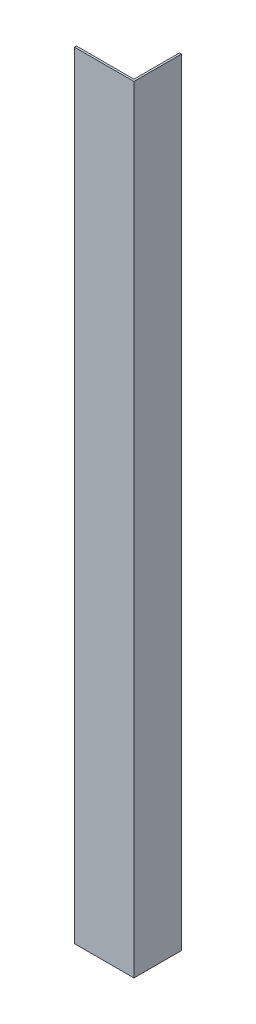
ISO-10303-21;
HEADER;
FILE_DESCRIPTION(('STEP AP214'),'2;1');
FILE_NAME('part.step','',(''),(''),'','','');
FILE_SCHEMA(('AUTOMOTIVE_DESIGN { 1 0 10303 214 1 1 1 1 }'));
ENDSEC;
DATA;
#1=APPLICATION_CONTEXT('core data for automotive mechanical design processes');
#2=APPLICATION_PROTOCOL_DEFINITION('international standard','automotive_design',2000,#1);
#3=PRODUCT_CONTEXT('',#1,'mechanical');
#4=PRODUCT('Part','Part','',(#3));
#5=PRODUCT_RELATED_PRODUCT_CATEGORY('part','',(#4));
#6=PRODUCT_DEFINITION_FORMATION('','',#4);
#7=PRODUCT_DEFINITION_CONTEXT('part definition',#1,'design');
#8=PRODUCT_DEFINITION('design','',#6,#7);
#9=PRODUCT_DEFINITION_SHAPE('','',#8);
#10=(LENGTH_UNIT() NAMED_UNIT(*) SI_UNIT(.MILLI.,.METRE.));
#11=(NAMED_UNIT(*) PLANE_ANGLE_UNIT() SI_UNIT($,.RADIAN.));
#12=(NAMED_UNIT(*) SI_UNIT($,.STERADIAN.) SOLID_ANGLE_UNIT());
#13=UNCERTAINTY_MEASURE_WITH_UNIT(LENGTH_MEASURE(1.E-05),#10,'distance_accuracy_value','');
#14=(GEOMETRIC_REPRESENTATION_CONTEXT(3) GLOBAL_UNCERTAINTY_ASSIGNED_CONTEXT((#13)) GLOBAL_UNIT_ASSIGNED_CONTEXT((#10,
#11,#12)) REPRESENTATION_CONTEXT('',''));
#15=CARTESIAN_POINT('',(0.,0.,0.));
#16=DIRECTION('',(0.,0.,1.));
#17=DIRECTION('',(1.,0.,0.));
#18=AXIS2_PLACEMENT_3D('',#15,#16,#17);
#19=CARTESIAN_POINT('',(0.,196.,-0.5));
#20=DIRECTION('',(1.,0.,0.));
#21=DIRECTION('',(0.,0.,-1.));
#22=AXIS2_PLACEMENT_3D('',#19,#20,#21);
#23=PLANE('',#22);
#24=DIRECTION('',(0.,0.,1.));
#25=VECTOR('',#24,1.);
#26=CARTESIAN_POINT('',(0.,0.,-0.5));
#27=LINE('',#26,#25);
#28=CARTESIAN_POINT('',(0.,0.,-0.5));
#29=VERTEX_POINT('',#28);
#30=CARTESIAN_POINT('',(0.,0.,0.));
#31=VERTEX_POINT('',#30);
#32=EDGE_CURVE('E123',#29,#31,#27,.T.);
#33=ORIENTED_EDGE('',*,*,#32,.T.);
#34=DIRECTION('',(0.,-1.,0.));
#35=VECTOR('',#34,1.);
#36=CARTESIAN_POINT('',(0.,196.,0.));
#37=LINE('',#36,#35);
#38=CARTESIAN_POINT('',(0.,196.,0.));
#39=VERTEX_POINT('',#38);
#40=EDGE_CURVE('E11',#39,#31,#37,.T.);
#41=ORIENTED_EDGE('',*,*,#40,.F.);
#42=DIRECTION('',(0.,0.,1.));
#43=VECTOR('',#42,1.);
#44=CARTESIAN_POINT('',(0.,196.,-0.5));
#45=LINE('',#44,#43);
#46=CARTESIAN_POINT('',(0.,196.,-0.5));
#47=VERTEX_POINT('',#46);
#48=EDGE_CURVE('E133',#47,#39,#45,.T.);
#49=ORIENTED_EDGE('',*,*,#48,.F.);
#50=DIRECTION('',(0.,-1.,0.));
#51=VECTOR('',#50,1.);
#52=CARTESIAN_POINT('',(0.,196.,-0.5));
#53=LINE('',#52,#51);
#54=EDGE_CURVE('E119',#47,#29,#53,.T.);
#55=ORIENTED_EDGE('',*,*,#54,.T.);
#56=EDGE_LOOP('',(#33,#41,#49,#55));
#57=FACE_BOUND('',#56,.T.);
#58=ADVANCED_FACE('F39',(#57),#23,.F.);
#59=CARTESIAN_POINT('',(0.,196.,0.));
#60=DIRECTION('',(0.,0.,-1.));
#61=DIRECTION('',(-1.,0.,0.));
#62=AXIS2_PLACEMENT_3D('',#59,#60,#61);
#63=PLANE('',#62);
#64=DIRECTION('',(1.,0.,0.));
#65=VECTOR('',#64,1.);
#66=CARTESIAN_POINT('',(0.,0.,0.));
#67=LINE('',#66,#65);
#68=CARTESIAN_POINT('',(15.,0.,0.));
#69=VERTEX_POINT('',#68);
#70=EDGE_CURVE('E126',#31,#69,#67,.T.);
#71=ORIENTED_EDGE('',*,*,#70,.T.);
#72=DIRECTION('',(0.,-1.,0.));
#73=VECTOR('',#72,1.);
#74=CARTESIAN_POINT('',(15.,196.,0.));
#75=LINE('',#74,#73);
#76=CARTESIAN_POINT('',(15.,196.,0.));
#77=VERTEX_POINT('',#76);
#78=EDGE_CURVE('E47',#77,#69,#75,.T.);
#79=ORIENTED_EDGE('',*,*,#78,.F.);
#80=DIRECTION('',(1.,0.,0.));
#81=VECTOR('',#80,1.);
#82=CARTESIAN_POINT('',(0.,196.,0.));
#83=LINE('',#82,#81);
#84=EDGE_CURVE('E92',#39,#77,#83,.T.);
#85=ORIENTED_EDGE('',*,*,#84,.F.);
#86=ORIENTED_EDGE('',*,*,#40,.T.);
#87=EDGE_LOOP('',(#71,#79,#85,#86));
#88=FACE_BOUND('',#87,.T.);
#89=ADVANCED_FACE('F157',(#88),#63,.F.);
#90=CARTESIAN_POINT('',(15.,196.,0.));
#91=DIRECTION('',(-1.,0.,0.));
#92=DIRECTION('',(0.,0.,1.));
#93=AXIS2_PLACEMENT_3D('',#90,#91,#92);
#94=PLANE('',#93);
#95=DIRECTION('',(0.,0.,-1.));
#96=VECTOR('',#95,1.);
#97=CARTESIAN_POINT('',(15.,0.,0.));
#98=LINE('',#97,#96);
#99=CARTESIAN_POINT('',(15.,0.,-12.));
#100=VERTEX_POINT('',#99);
#101=EDGE_CURVE('E128',#69,#100,#98,.T.);
#102=ORIENTED_EDGE('',*,*,#101,.T.);
#103=DIRECTION('',(0.,-1.,0.));
#104=VECTOR('',#103,1.);
#105=CARTESIAN_POINT('',(15.,196.,-12.));
#106=LINE('',#105,#104);
#107=CARTESIAN_POINT('',(15.,196.,-12.));
#108=VERTEX_POINT('',#107);
#109=EDGE_CURVE('E114',#108,#100,#106,.T.);
#110=ORIENTED_EDGE('',*,*,#109,.F.);
#111=DIRECTION('',(0.,0.,-1.));
#112=VECTOR('',#111,1.);
#113=CARTESIAN_POINT('',(15.,196.,0.));
#114=LINE('',#113,#112);
#115=EDGE_CURVE('E105',#77,#108,#114,.T.);
#116=ORIENTED_EDGE('',*,*,#115,.F.);
#117=ORIENTED_EDGE('',*,*,#78,.T.);
#118=EDGE_LOOP('',(#102,#110,#116,#117));
#119=FACE_BOUND('',#118,.T.);
#120=ADVANCED_FACE('F139',(#119),#94,.F.);
#121=CARTESIAN_POINT('',(15.,196.,-12.));
#122=DIRECTION('',(0.,0.,1.));
#123=DIRECTION('',(1.,0.,0.));
#124=AXIS2_PLACEMENT_3D('',#121,#122,#123);
#125=PLANE('',#124);
#126=DIRECTION('',(-1.,0.,0.));
#127=VECTOR('',#126,1.);
#128=CARTESIAN_POINT('',(15.,0.,-12.));
#129=LINE('',#128,#127);
#130=CARTESIAN_POINT('',(14.5,0.,-12.));
#131=VERTEX_POINT('',#130);
#132=EDGE_CURVE('E113',#100,#131,#129,.T.);
#133=ORIENTED_EDGE('',*,*,#132,.T.);
#134=DIRECTION('',(0.,-1.,0.));
#135=VECTOR('',#134,1.);
#136=CARTESIAN_POINT('',(14.5,196.,-12.));
#137=LINE('',#136,#135);
#138=CARTESIAN_POINT('',(14.5,196.,-12.));
#139=VERTEX_POINT('',#138);
#140=EDGE_CURVE('E110',#139,#131,#137,.T.);
#141=ORIENTED_EDGE('',*,*,#140,.F.);
#142=DIRECTION('',(-1.,0.,0.));
#143=VECTOR('',#142,1.);
#144=CARTESIAN_POINT('',(15.,196.,-12.));
#145=LINE('',#144,#143);
#146=EDGE_CURVE('E99',#108,#139,#145,.T.);
#147=ORIENTED_EDGE('',*,*,#146,.F.);
#148=ORIENTED_EDGE('',*,*,#109,.T.);
#149=EDGE_LOOP('',(#133,#141,#147,#148));
#150=FACE_BOUND('',#149,.T.);
#151=ADVANCED_FACE('F111',(#150),#125,.F.);
#152=CARTESIAN_POINT('',(14.5,196.,-12.));
#153=DIRECTION('',(1.,0.,0.));
#154=DIRECTION('',(0.,0.,-1.));
#155=AXIS2_PLACEMENT_3D('',#152,#153,#154);
#156=PLANE('',#155);
#157=DIRECTION('',(0.,0.,1.));
#158=VECTOR('',#157,1.);
#159=CARTESIAN_POINT('',(14.5,0.,-12.));
#160=LINE('',#159,#158);
#161=CARTESIAN_POINT('',(14.5,0.,-0.500000000000002));
#162=VERTEX_POINT('',#161);
#163=EDGE_CURVE('E78',#131,#162,#160,.T.);
#164=ORIENTED_EDGE('',*,*,#163,.T.);
#165=DIRECTION('',(0.,-1.,0.));
#166=VECTOR('',#165,1.);
#167=CARTESIAN_POINT('',(14.5,196.,-0.500000000000002));
#168=LINE('',#167,#166);
#169=CARTESIAN_POINT('',(14.5,196.,-0.500000000000002));
#170=VERTEX_POINT('',#169);
#171=EDGE_CURVE('E115',#170,#162,#168,.T.);
#172=ORIENTED_EDGE('',*,*,#171,.F.);
#173=DIRECTION('',(0.,0.,1.));
#174=VECTOR('',#173,1.);
#175=CARTESIAN_POINT('',(14.5,196.,-12.));
#176=LINE('',#175,#174);
#177=EDGE_CURVE('E103',#139,#170,#176,.T.);
#178=ORIENTED_EDGE('',*,*,#177,.F.);
#179=ORIENTED_EDGE('',*,*,#140,.T.);
#180=EDGE_LOOP('',(#164,#172,#178,#179));
#181=FACE_BOUND('',#180,.T.);
#182=ADVANCED_FACE('F117',(#181),#156,.F.);
#183=CARTESIAN_POINT('',(14.5,196.,-0.500000000000002));
#184=DIRECTION('',(0.,0.,1.));
#185=DIRECTION('',(1.,0.,0.));
#186=AXIS2_PLACEMENT_3D('',#183,#184,#185);
#187=PLANE('',#186);
#188=DIRECTION('',(-1.,0.,0.));
#189=VECTOR('',#188,1.);
#190=CARTESIAN_POINT('',(14.5,0.,-0.500000000000002));
#191=LINE('',#190,#189);
#192=EDGE_CURVE('E84',#162,#29,#191,.T.);
#193=ORIENTED_EDGE('',*,*,#192,.T.);
#194=ORIENTED_EDGE('',*,*,#54,.F.);
#195=DIRECTION('',(-1.,0.,0.));
#196=VECTOR('',#195,1.);
#197=CARTESIAN_POINT('',(14.5,196.,-0.500000000000002));
#198=LINE('',#197,#196);
#199=EDGE_CURVE('E55',#170,#47,#198,.T.);
#200=ORIENTED_EDGE('',*,*,#199,.F.);
#201=ORIENTED_EDGE('',*,*,#171,.T.);
#202=EDGE_LOOP('',(#193,#194,#200,#201));
#203=FACE_BOUND('',#202,.T.);
#204=ADVANCED_FACE('F146',(#203),#187,.F.);
#205=CARTESIAN_POINT('',(0.,196.,0.));
#206=DIRECTION('',(0.,1.,0.));
#207=DIRECTION('',(0.,0.,1.));
#208=AXIS2_PLACEMENT_3D('',#205,#206,#207);
#209=PLANE('',#208);
#210=ORIENTED_EDGE('',*,*,#48,.T.);
#211=ORIENTED_EDGE('',*,*,#84,.T.);
#212=ORIENTED_EDGE('',*,*,#115,.T.);
#213=ORIENTED_EDGE('',*,*,#146,.T.);
#214=ORIENTED_EDGE('',*,*,#177,.T.);
#215=ORIENTED_EDGE('',*,*,#199,.T.);
#216=EDGE_LOOP('',(#210,#211,#212,#213,#214,#215));
#217=FACE_BOUND('',#216,.T.);
#218=ADVANCED_FACE('F101',(#217),#209,.T.);
#219=CARTESIAN_POINT('',(0.,0.,0.));
#220=DIRECTION('',(0.,1.,0.));
#221=DIRECTION('',(0.,0.,1.));
#222=AXIS2_PLACEMENT_3D('',#219,#220,#221);
#223=PLANE('',#222);
#224=ORIENTED_EDGE('',*,*,#32,.F.);
#225=ORIENTED_EDGE('',*,*,#192,.F.);
#226=ORIENTED_EDGE('',*,*,#163,.F.);
#227=ORIENTED_EDGE('',*,*,#132,.F.);
#228=ORIENTED_EDGE('',*,*,#101,.F.);
#229=ORIENTED_EDGE('',*,*,#70,.F.);
#230=EDGE_LOOP('',(#224,#225,#226,#227,#228,#229));
#231=FACE_BOUND('',#230,.T.);
#232=ADVANCED_FACE('F142',(#231),#223,.F.);
#233=CLOSED_SHELL('',(#58,#89,#120,#151,#182,#204,#218,#232));
#234=MANIFOLD_SOLID_BREP('B2',#233);
#235=ADVANCED_BREP_SHAPE_REPRESENTATION('',(#18,#234),#14);
#236=SHAPE_DEFINITION_REPRESENTATION(#9,#235);
ENDSEC;
END-ISO-10303-21;
